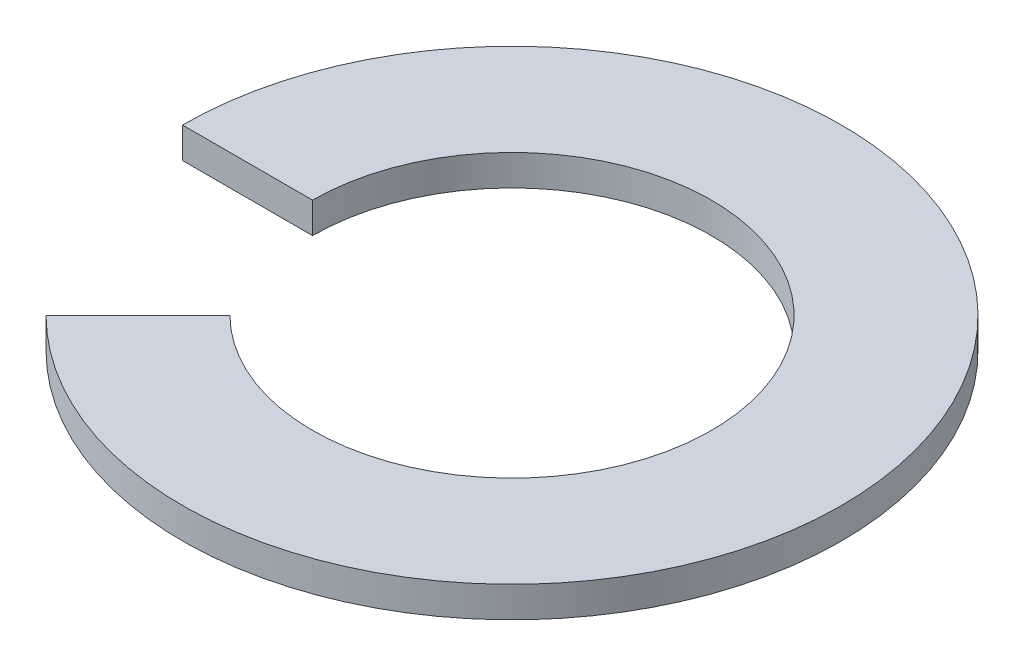
ISO-10303-21;
HEADER;
FILE_DESCRIPTION(('STEP AP214'),'2;1');
FILE_NAME('part.step','',(''),(''),'','','');
FILE_SCHEMA(('AUTOMOTIVE_DESIGN { 1 0 10303 214 1 1 1 1 }'));
ENDSEC;
DATA;
#1=APPLICATION_CONTEXT('core data for automotive mechanical design processes');
#2=APPLICATION_PROTOCOL_DEFINITION('international standard','automotive_design',2000,#1);
#3=PRODUCT_CONTEXT('',#1,'mechanical');
#4=PRODUCT('Part','Part','',(#3));
#5=PRODUCT_RELATED_PRODUCT_CATEGORY('part','',(#4));
#6=PRODUCT_DEFINITION_FORMATION('','',#4);
#7=PRODUCT_DEFINITION_CONTEXT('part definition',#1,'design');
#8=PRODUCT_DEFINITION('design','',#6,#7);
#9=PRODUCT_DEFINITION_SHAPE('','',#8);
#10=(LENGTH_UNIT() NAMED_UNIT(*) SI_UNIT(.MILLI.,.METRE.));
#11=(NAMED_UNIT(*) PLANE_ANGLE_UNIT() SI_UNIT($,.RADIAN.));
#12=(NAMED_UNIT(*) SI_UNIT($,.STERADIAN.) SOLID_ANGLE_UNIT());
#13=UNCERTAINTY_MEASURE_WITH_UNIT(LENGTH_MEASURE(1.E-05),#10,'distance_accuracy_value','');
#14=(GEOMETRIC_REPRESENTATION_CONTEXT(3) GLOBAL_UNCERTAINTY_ASSIGNED_CONTEXT((#13)) GLOBAL_UNIT_ASSIGNED_CONTEXT((#10,
#11,#12)) REPRESENTATION_CONTEXT('',''));
#15=CARTESIAN_POINT('',(0.,0.,0.));
#16=DIRECTION('',(0.,0.,1.));
#17=DIRECTION('',(1.,0.,0.));
#18=AXIS2_PLACEMENT_3D('',#15,#16,#17);
#19=CARTESIAN_POINT('',(0.,1.5,0.));
#20=DIRECTION('',(0.707106781186549,0.,0.707106781186546));
#21=DIRECTION('',(0.707106781186546,0.,-0.707106781186549));
#22=AXIS2_PLACEMENT_3D('',#19,#20,#21);
#23=PLANE('',#22);
#24=DIRECTION('',(-0.707106781186546,0.,0.707106781186549));
#25=VECTOR('',#24,1.);
#26=CARTESIAN_POINT('',(0.,0.,0.));
#27=LINE('',#26,#25);
#28=CARTESIAN_POINT('',(-6.87661344703916,0.,6.87661344703919));
#29=VERTEX_POINT('',#28);
#30=CARTESIAN_POINT('',(-11.3600239931525,0.,11.3600239931525));
#31=VERTEX_POINT('',#30);
#32=EDGE_CURVE('E101',#29,#31,#27,.T.);
#33=ORIENTED_EDGE('',*,*,#32,.T.);
#34=DIRECTION('',(0.,-1.,0.));
#35=VECTOR('',#34,1.);
#36=CARTESIAN_POINT('',(-11.3600239931525,1.5,11.3600239931525));
#37=LINE('',#36,#35);
#38=CARTESIAN_POINT('',(-11.3600239931525,1.5,11.3600239931525));
#39=VERTEX_POINT('',#38);
#40=EDGE_CURVE('E11',#39,#31,#37,.T.);
#41=ORIENTED_EDGE('',*,*,#40,.F.);
#42=DIRECTION('',(-0.707106781186546,0.,0.707106781186549));
#43=VECTOR('',#42,1.);
#44=CARTESIAN_POINT('',(0.,1.5,0.));
#45=LINE('',#44,#43);
#46=CARTESIAN_POINT('',(-6.87661344703916,1.5,6.87661344703919));
#47=VERTEX_POINT('',#46);
#48=EDGE_CURVE('E87',#47,#39,#45,.T.);
#49=ORIENTED_EDGE('',*,*,#48,.F.);
#50=DIRECTION('',(0.,-1.,0.));
#51=VECTOR('',#50,1.);
#52=CARTESIAN_POINT('',(-6.87661344703916,1.5,6.87661344703919));
#53=LINE('',#52,#51);
#54=EDGE_CURVE('E54',#47,#29,#53,.T.);
#55=ORIENTED_EDGE('',*,*,#54,.T.);
#56=EDGE_LOOP('',(#33,#41,#49,#55));
#57=FACE_BOUND('',#56,.T.);
#58=ADVANCED_FACE('F38',(#57),#23,.F.);
#59=CARTESIAN_POINT('',(0.,1.5,0.));
#60=DIRECTION('',(0.,-1.,0.));
#61=DIRECTION('',(0.,0.,-1.));
#62=AXIS2_PLACEMENT_3D('',#59,#60,#61);
#63=CYLINDRICAL_SURFACE('',#62,16.0655);
#64=CARTESIAN_POINT('',(0.,0.,0.));
#65=DIRECTION('',(0.,1.,0.));
#66=DIRECTION('',(0.,0.,1.));
#67=AXIS2_PLACEMENT_3D('',#64,#65,#66);
#68=CIRCLE('',#67,16.0655);
#69=CARTESIAN_POINT('',(-16.0655,0.,0.));
#70=VERTEX_POINT('',#69);
#71=EDGE_CURVE('E92',#31,#70,#68,.T.);
#72=ORIENTED_EDGE('',*,*,#71,.T.);
#73=DIRECTION('',(0.,-1.,0.));
#74=VECTOR('',#73,1.);
#75=CARTESIAN_POINT('',(-16.0655,1.5,0.));
#76=LINE('',#75,#74);
#77=CARTESIAN_POINT('',(-16.0655,1.5,0.));
#78=VERTEX_POINT('',#77);
#79=EDGE_CURVE('E46',#78,#70,#76,.T.);
#80=ORIENTED_EDGE('',*,*,#79,.F.);
#81=CARTESIAN_POINT('',(0.,1.5,0.));
#82=DIRECTION('',(0.,1.,0.));
#83=DIRECTION('',(0.,0.,1.));
#84=AXIS2_PLACEMENT_3D('',#81,#82,#83);
#85=CIRCLE('',#84,16.0655);
#86=EDGE_CURVE('E79',#39,#78,#85,.T.);
#87=ORIENTED_EDGE('',*,*,#86,.F.);
#88=ORIENTED_EDGE('',*,*,#40,.T.);
#89=EDGE_LOOP('',(#72,#80,#87,#88));
#90=FACE_BOUND('',#89,.T.);
#91=ADVANCED_FACE('F91',(#90),#63,.T.);
#92=CARTESIAN_POINT('',(0.,1.5,0.));
#93=DIRECTION('',(0.,0.,1.));
#94=DIRECTION('',(1.,0.,0.));
#95=AXIS2_PLACEMENT_3D('',#92,#93,#94);
#96=PLANE('',#95);
#97=DIRECTION('',(-1.,0.,0.));
#98=VECTOR('',#97,1.);
#99=CARTESIAN_POINT('',(0.,0.,0.));
#100=LINE('',#99,#98);
#101=CARTESIAN_POINT('',(-9.725,0.,0.));
#102=VERTEX_POINT('',#101);
#103=EDGE_CURVE('E104',#102,#70,#100,.T.);
#104=ORIENTED_EDGE('',*,*,#103,.F.);
#105=DIRECTION('',(0.,-1.,0.));
#106=VECTOR('',#105,1.);
#107=CARTESIAN_POINT('',(-9.725,1.5,0.));
#108=LINE('',#107,#106);
#109=CARTESIAN_POINT('',(-9.725,1.5,0.));
#110=VERTEX_POINT('',#109);
#111=EDGE_CURVE('E68',#110,#102,#108,.T.);
#112=ORIENTED_EDGE('',*,*,#111,.F.);
#113=DIRECTION('',(-1.,0.,0.));
#114=VECTOR('',#113,1.);
#115=CARTESIAN_POINT('',(0.,1.5,0.));
#116=LINE('',#115,#114);
#117=EDGE_CURVE('E86',#110,#78,#116,.T.);
#118=ORIENTED_EDGE('',*,*,#117,.T.);
#119=ORIENTED_EDGE('',*,*,#79,.T.);
#120=EDGE_LOOP('',(#104,#112,#118,#119));
#121=FACE_BOUND('',#120,.T.);
#122=ADVANCED_FACE('F95',(#121),#96,.T.);
#123=CARTESIAN_POINT('',(0.,1.5,0.));
#124=DIRECTION('',(0.,-1.,0.));
#125=DIRECTION('',(0.,0.,-1.));
#126=AXIS2_PLACEMENT_3D('',#123,#124,#125);
#127=CYLINDRICAL_SURFACE('',#126,9.725);
#128=CARTESIAN_POINT('',(0.,0.,0.));
#129=DIRECTION('',(0.,1.,0.));
#130=DIRECTION('',(0.,0.,1.));
#131=AXIS2_PLACEMENT_3D('',#128,#129,#130);
#132=CIRCLE('',#131,9.725);
#133=EDGE_CURVE('E106',#29,#102,#132,.T.);
#134=ORIENTED_EDGE('',*,*,#133,.F.);
#135=ORIENTED_EDGE('',*,*,#54,.F.);
#136=CARTESIAN_POINT('',(0.,1.5,0.));
#137=DIRECTION('',(0.,1.,0.));
#138=DIRECTION('',(0.,0.,1.));
#139=AXIS2_PLACEMENT_3D('',#136,#137,#138);
#140=CIRCLE('',#139,9.725);
#141=EDGE_CURVE('E96',#47,#110,#140,.T.);
#142=ORIENTED_EDGE('',*,*,#141,.T.);
#143=ORIENTED_EDGE('',*,*,#111,.T.);
#144=EDGE_LOOP('',(#134,#135,#142,#143));
#145=FACE_BOUND('',#144,.T.);
#146=ADVANCED_FACE('F112',(#145),#127,.F.);
#147=CARTESIAN_POINT('',(0.,1.5,0.));
#148=DIRECTION('',(0.,1.,0.));
#149=DIRECTION('',(0.,0.,1.));
#150=AXIS2_PLACEMENT_3D('',#147,#148,#149);
#151=PLANE('',#150);
#152=ORIENTED_EDGE('',*,*,#48,.T.);
#153=ORIENTED_EDGE('',*,*,#86,.T.);
#154=ORIENTED_EDGE('',*,*,#117,.F.);
#155=ORIENTED_EDGE('',*,*,#141,.F.);
#156=EDGE_LOOP('',(#152,#153,#154,#155));
#157=FACE_BOUND('',#156,.T.);
#158=ADVANCED_FACE('F83',(#157),#151,.T.);
#159=CARTESIAN_POINT('',(0.,0.,0.));
#160=DIRECTION('',(0.,1.,0.));
#161=DIRECTION('',(0.,0.,1.));
#162=AXIS2_PLACEMENT_3D('',#159,#160,#161);
#163=PLANE('',#162);
#164=ORIENTED_EDGE('',*,*,#32,.F.);
#165=ORIENTED_EDGE('',*,*,#133,.T.);
#166=ORIENTED_EDGE('',*,*,#103,.T.);
#167=ORIENTED_EDGE('',*,*,#71,.F.);
#168=EDGE_LOOP('',(#164,#165,#166,#167));
#169=FACE_BOUND('',#168,.T.);
#170=ADVANCED_FACE('F111',(#169),#163,.F.);
#171=CLOSED_SHELL('',(#58,#91,#122,#146,#158,#170));
#172=MANIFOLD_SOLID_BREP('B2',#171);
#173=ADVANCED_BREP_SHAPE_REPRESENTATION('',(#18,#172),#14);
#174=SHAPE_DEFINITION_REPRESENTATION(#9,#173);
ENDSEC;
END-ISO-10303-21;
